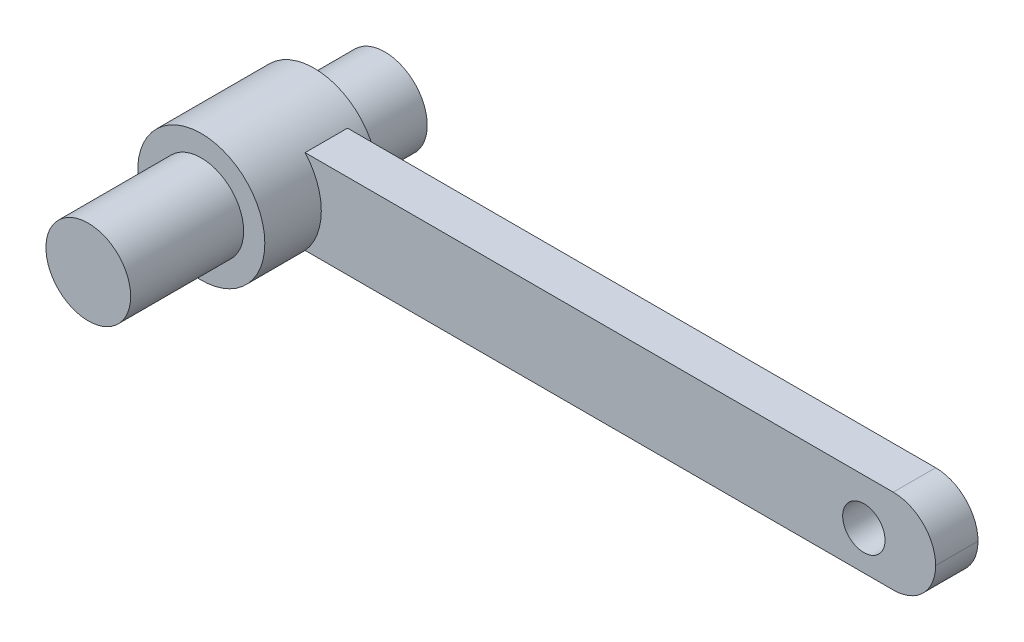
ISO-10303-21;
HEADER;
FILE_DESCRIPTION(('STEP AP214'),'2;1');
FILE_NAME('part.step','',(''),(''),'','','');
FILE_SCHEMA(('AUTOMOTIVE_DESIGN { 1 0 10303 214 1 1 1 1 }'));
ENDSEC;
DATA;
#1=APPLICATION_CONTEXT('core data for automotive mechanical design processes');
#2=APPLICATION_PROTOCOL_DEFINITION('international standard','automotive_design',2000,#1);
#3=PRODUCT_CONTEXT('',#1,'mechanical');
#4=PRODUCT('Part','Part','',(#3));
#5=PRODUCT_RELATED_PRODUCT_CATEGORY('part','',(#4));
#6=PRODUCT_DEFINITION_FORMATION('','',#4);
#7=PRODUCT_DEFINITION_CONTEXT('part definition',#1,'design');
#8=PRODUCT_DEFINITION('design','',#6,#7);
#9=PRODUCT_DEFINITION_SHAPE('','',#8);
#10=(LENGTH_UNIT() NAMED_UNIT(*) SI_UNIT(.MILLI.,.METRE.));
#11=(NAMED_UNIT(*) PLANE_ANGLE_UNIT() SI_UNIT($,.RADIAN.));
#12=(NAMED_UNIT(*) SI_UNIT($,.STERADIAN.) SOLID_ANGLE_UNIT());
#13=UNCERTAINTY_MEASURE_WITH_UNIT(LENGTH_MEASURE(1.E-05),#10,'distance_accuracy_value','');
#14=(GEOMETRIC_REPRESENTATION_CONTEXT(3) GLOBAL_UNCERTAINTY_ASSIGNED_CONTEXT((#13)) GLOBAL_UNIT_ASSIGNED_CONTEXT((#10,
#11,#12)) REPRESENTATION_CONTEXT('',''));
#15=CARTESIAN_POINT('',(0.,0.,0.));
#16=DIRECTION('',(0.,0.,1.));
#17=DIRECTION('',(1.,0.,0.));
#18=AXIS2_PLACEMENT_3D('',#15,#16,#17);
#19=CARTESIAN_POINT('',(-10.5,-0.5,0.8));
#20=DIRECTION('',(0.,0.,1.));
#21=DIRECTION('',(1.,0.,0.));
#22=AXIS2_PLACEMENT_3D('',#19,#20,#21);
#23=PLANE('',#22);
#24=CARTESIAN_POINT('',(-10.5,-0.5,0.8));
#25=DIRECTION('',(0.,0.,1.));
#26=DIRECTION('',(1.,0.,0.));
#27=AXIS2_PLACEMENT_3D('',#24,#25,#26);
#28=CIRCLE('',#27,0.45);
#29=CARTESIAN_POINT('',(-10.05,-0.5,0.8));
#30=VERTEX_POINT('',#29);
#31=EDGE_CURVE('E107',#30,#30,#28,.T.);
#32=ORIENTED_EDGE('',*,*,#31,.T.);
#33=EDGE_LOOP('',(#32));
#34=FACE_BOUND('',#33,.T.);
#35=CARTESIAN_POINT('',(-10.5,-0.5,0.8));
#36=DIRECTION('',(0.,0.,1.));
#37=DIRECTION('',(1.,0.,0.));
#38=AXIS2_PLACEMENT_3D('',#35,#36,#37);
#39=CIRCLE('',#38,0.3);
#40=CARTESIAN_POINT('',(-10.2,-0.5,0.8));
#41=VERTEX_POINT('',#40);
#42=EDGE_CURVE('E143',#41,#41,#39,.T.);
#43=ORIENTED_EDGE('',*,*,#42,.F.);
#44=EDGE_LOOP('',(#43));
#45=FACE_BOUND('',#44,.T.);
#46=ADVANCED_FACE('F30',(#34,#45),#23,.T.);
#47=CARTESIAN_POINT('',(-10.5,-0.5,0.));
#48=DIRECTION('',(0.,0.,1.));
#49=DIRECTION('',(1.,0.,0.));
#50=AXIS2_PLACEMENT_3D('',#47,#48,#49);
#51=PLANE('',#50);
#52=CARTESIAN_POINT('',(-10.5,-0.5,0.));
#53=DIRECTION('',(0.,0.,1.));
#54=DIRECTION('',(1.,0.,0.));
#55=AXIS2_PLACEMENT_3D('',#52,#53,#54);
#56=CIRCLE('',#55,0.45);
#57=CARTESIAN_POINT('',(-10.05,-0.5,0.));
#58=VERTEX_POINT('',#57);
#59=EDGE_CURVE('E146',#58,#58,#56,.T.);
#60=ORIENTED_EDGE('',*,*,#59,.F.);
#61=EDGE_LOOP('',(#60));
#62=FACE_BOUND('',#61,.T.);
#63=CARTESIAN_POINT('',(-10.5,-0.5,0.));
#64=DIRECTION('',(0.,0.,1.));
#65=DIRECTION('',(1.,0.,0.));
#66=AXIS2_PLACEMENT_3D('',#63,#64,#65);
#67=CIRCLE('',#66,0.3);
#68=CARTESIAN_POINT('',(-10.2,-0.5,0.));
#69=VERTEX_POINT('',#68);
#70=EDGE_CURVE('E125',#69,#69,#67,.T.);
#71=ORIENTED_EDGE('',*,*,#70,.T.);
#72=EDGE_LOOP('',(#71));
#73=FACE_BOUND('',#72,.T.);
#74=ADVANCED_FACE('F152',(#62,#73),#51,.F.);
#75=CARTESIAN_POINT('',(-10.5,-0.5,0.8));
#76=DIRECTION('',(0.,0.,-1.));
#77=DIRECTION('',(-1.,0.,0.));
#78=AXIS2_PLACEMENT_3D('',#75,#76,#77);
#79=CYLINDRICAL_SURFACE('',#78,0.45);
#80=CARTESIAN_POINT('',(-10.5,-0.5,0.0999999999999578));
#81=DIRECTION('',(0.,0.,-1.));
#82=DIRECTION('',(0.,1.,0.));
#83=AXIS2_PLACEMENT_3D('',#80,#81,#82);
#84=CIRCLE('',#83,0.45);
#85=CARTESIAN_POINT('',(-10.164589803375,-0.200000000000002,0.0999999999999578));
#86=VERTEX_POINT('',#85);
#87=CARTESIAN_POINT('',(-10.164589803375,-0.799999999999999,0.0999999999999578));
#88=VERTEX_POINT('',#87);
#89=EDGE_CURVE('E97',#86,#88,#84,.T.);
#90=ORIENTED_EDGE('',*,*,#89,.T.);
#91=DIRECTION('',(0.,0.,-1.));
#92=VECTOR('',#91,1.);
#93=CARTESIAN_POINT('',(-10.164589803375,-0.799999999999999,0.8));
#94=LINE('',#93,#92);
#95=CARTESIAN_POINT('',(-10.164589803375,-0.8,0.399999999999958));
#96=VERTEX_POINT('',#95);
#97=EDGE_CURVE('E83',#88,#96,#94,.F.);
#98=ORIENTED_EDGE('',*,*,#97,.T.);
#99=CARTESIAN_POINT('',(-10.5,-0.5,0.399999999999958));
#100=DIRECTION('',(0.,0.,1.));
#101=DIRECTION('',(0.,-1.,0.));
#102=AXIS2_PLACEMENT_3D('',#99,#100,#101);
#103=CIRCLE('',#102,0.45);
#104=CARTESIAN_POINT('',(-10.164589803375,-0.200000000000001,0.399999999999958));
#105=VERTEX_POINT('',#104);
#106=EDGE_CURVE('E92',#96,#105,#103,.T.);
#107=ORIENTED_EDGE('',*,*,#106,.T.);
#108=DIRECTION('',(0.,0.,-1.));
#109=VECTOR('',#108,1.);
#110=CARTESIAN_POINT('',(-10.164589803375,-0.199999999999999,0.8));
#111=LINE('',#110,#109);
#112=EDGE_CURVE('E103',#105,#86,#111,.T.);
#113=ORIENTED_EDGE('',*,*,#112,.T.);
#114=EDGE_LOOP('',(#90,#98,#107,#113));
#115=FACE_BOUND('',#114,.T.);
#116=ORIENTED_EDGE('',*,*,#31,.F.);
#117=EDGE_LOOP('',(#116));
#118=FACE_BOUND('',#117,.T.);
#119=ORIENTED_EDGE('',*,*,#59,.T.);
#120=EDGE_LOOP('',(#119));
#121=FACE_BOUND('',#120,.T.);
#122=ADVANCED_FACE('F100',(#115,#118,#121),#79,.T.);
#123=CARTESIAN_POINT('',(-5.69999999999998,-0.799999999999999,-0.413197170165134));
#124=DIRECTION('',(0.,-1.,0.));
#125=DIRECTION('',(0.,0.,-1.));
#126=AXIS2_PLACEMENT_3D('',#123,#124,#125);
#127=PLANE('',#126);
#128=DIRECTION('',(-1.,0.,0.));
#129=VECTOR('',#128,1.);
#130=CARTESIAN_POINT('',(-5.69999999999993,-0.799999999999999,0.0999999999999578));
#131=LINE('',#130,#129);
#132=CARTESIAN_POINT('',(-5.99999999999993,-0.799999999999999,0.0999999999999578));
#133=VERTEX_POINT('',#132);
#134=EDGE_CURVE('E98',#133,#88,#131,.T.);
#135=ORIENTED_EDGE('',*,*,#134,.F.);
#136=DIRECTION('',(0.,0.,1.));
#137=VECTOR('',#136,1.);
#138=CARTESIAN_POINT('',(-5.99999999999993,-0.799999999999999,-0.413197170165134));
#139=LINE('',#138,#137);
#140=CARTESIAN_POINT('',(-5.99999999999993,-0.8,0.399999999999958));
#141=VERTEX_POINT('',#140);
#142=EDGE_CURVE('E86',#133,#141,#139,.T.);
#143=ORIENTED_EDGE('',*,*,#142,.T.);
#144=DIRECTION('',(-1.,0.,0.));
#145=VECTOR('',#144,1.);
#146=CARTESIAN_POINT('',(-5.7,-0.8,0.399999999999958));
#147=LINE('',#146,#145);
#148=EDGE_CURVE('E78',#141,#96,#147,.T.);
#149=ORIENTED_EDGE('',*,*,#148,.T.);
#150=ORIENTED_EDGE('',*,*,#97,.F.);
#151=EDGE_LOOP('',(#135,#143,#149,#150));
#152=FACE_BOUND('',#151,.T.);
#153=ADVANCED_FACE('F81',(#152),#127,.T.);
#154=CARTESIAN_POINT('',(-5.69999999999993,-0.199999999999999,-0.413197170165134));
#155=DIRECTION('',(0.,1.,0.));
#156=DIRECTION('',(0.,0.,1.));
#157=AXIS2_PLACEMENT_3D('',#154,#155,#156);
#158=PLANE('',#157);
#159=DIRECTION('',(-1.,0.,0.));
#160=VECTOR('',#159,1.);
#161=CARTESIAN_POINT('',(-5.7,-0.200000000000001,0.399999999999958));
#162=LINE('',#161,#160);
#163=CARTESIAN_POINT('',(-5.99999999999993,-0.200000000000001,0.399999999999958));
#164=VERTEX_POINT('',#163);
#165=EDGE_CURVE('E88',#164,#105,#162,.T.);
#166=ORIENTED_EDGE('',*,*,#165,.F.);
#167=DIRECTION('',(0.,0.,-1.));
#168=VECTOR('',#167,1.);
#169=CARTESIAN_POINT('',(-5.99999999999993,-0.199999999999999,-0.413197170165134));
#170=LINE('',#169,#168);
#171=CARTESIAN_POINT('',(-5.99999999999993,-0.200000000000002,0.0999999999999578));
#172=VERTEX_POINT('',#171);
#173=EDGE_CURVE('E11',#164,#172,#170,.T.);
#174=ORIENTED_EDGE('',*,*,#173,.T.);
#175=DIRECTION('',(-1.,0.,0.));
#176=VECTOR('',#175,1.);
#177=CARTESIAN_POINT('',(-5.6999999999999,-0.200000000000002,0.0999999999999578));
#178=LINE('',#177,#176);
#179=EDGE_CURVE('E119',#172,#86,#178,.T.);
#180=ORIENTED_EDGE('',*,*,#179,.T.);
#181=ORIENTED_EDGE('',*,*,#112,.F.);
#182=EDGE_LOOP('',(#166,#174,#180,#181));
#183=FACE_BOUND('',#182,.T.);
#184=ADVANCED_FACE('F187',(#183),#158,.T.);
#185=CARTESIAN_POINT('',(-5.69999999999992,-0.499999999999999,0.0999999999999578));
#186=DIRECTION('',(0.,0.,-1.));
#187=DIRECTION('',(0.,1.,0.));
#188=AXIS2_PLACEMENT_3D('',#185,#186,#187);
#189=PLANE('',#188);
#190=CARTESIAN_POINT('',(-6.2082255628475,-0.524292893526734,0.0999999999999578));
#191=DIRECTION('',(0.,0.,-1.));
#192=DIRECTION('',(0.,1.,0.));
#193=AXIS2_PLACEMENT_3D('',#190,#191,#192);
#194=CIRCLE('',#193,0.15);
#195=CARTESIAN_POINT('',(-6.2082255628475,-0.374292893526734,0.0999999999999578));
#196=VERTEX_POINT('',#195);
#197=EDGE_CURVE('E89',#196,#196,#194,.T.);
#198=ORIENTED_EDGE('',*,*,#197,.F.);
#199=EDGE_LOOP('',(#198));
#200=FACE_BOUND('',#199,.T.);
#201=CARTESIAN_POINT('',(-5.99999999999993,-0.499999999999999,0.0999999999999578));
#202=DIRECTION('',(0.,0.,-1.));
#203=DIRECTION('',(0.,1.,0.));
#204=AXIS2_PLACEMENT_3D('',#201,#202,#203);
#205=CIRCLE('',#204,0.3);
#206=CARTESIAN_POINT('',(-5.69999999999992,-0.499999999999999,0.0999999999999578));
#207=VERTEX_POINT('',#206);
#208=EDGE_CURVE('E46',#172,#207,#205,.T.);
#209=ORIENTED_EDGE('',*,*,#208,.T.);
#210=CARTESIAN_POINT('',(-5.99999999999993,-0.5,0.0999999999999578));
#211=DIRECTION('',(0.,0.,-1.));
#212=DIRECTION('',(0.,1.,0.));
#213=AXIS2_PLACEMENT_3D('',#210,#211,#212);
#214=CIRCLE('',#213,0.3);
#215=EDGE_CURVE('E39',#207,#133,#214,.T.);
#216=ORIENTED_EDGE('',*,*,#215,.T.);
#217=ORIENTED_EDGE('',*,*,#134,.T.);
#218=ORIENTED_EDGE('',*,*,#89,.F.);
#219=ORIENTED_EDGE('',*,*,#179,.F.);
#220=EDGE_LOOP('',(#209,#216,#217,#218,#219));
#221=FACE_BOUND('',#220,.T.);
#222=ADVANCED_FACE('F116',(#200,#221),#189,.T.);
#223=CARTESIAN_POINT('',(-5.69999999999993,-0.5,0.399999999999958));
#224=DIRECTION('',(0.,0.,1.));
#225=DIRECTION('',(0.,-1.,0.));
#226=AXIS2_PLACEMENT_3D('',#223,#224,#225);
#227=PLANE('',#226);
#228=CARTESIAN_POINT('',(-6.2082255628475,-0.524292893526734,0.399999999999958));
#229=DIRECTION('',(0.,0.,1.));
#230=DIRECTION('',(1.,0.,0.));
#231=AXIS2_PLACEMENT_3D('',#228,#229,#230);
#232=CIRCLE('',#231,0.15);
#233=CARTESIAN_POINT('',(-6.0582255628475,-0.524292893526734,0.399999999999958));
#234=VERTEX_POINT('',#233);
#235=EDGE_CURVE('E124',#234,#234,#232,.T.);
#236=ORIENTED_EDGE('',*,*,#235,.F.);
#237=EDGE_LOOP('',(#236));
#238=FACE_BOUND('',#237,.T.);
#239=ORIENTED_EDGE('',*,*,#148,.F.);
#240=CARTESIAN_POINT('',(-5.99999999999993,-0.5,0.399999999999958));
#241=DIRECTION('',(0.,0.,1.));
#242=DIRECTION('',(0.,-1.,0.));
#243=AXIS2_PLACEMENT_3D('',#240,#241,#242);
#244=CIRCLE('',#243,0.3);
#245=CARTESIAN_POINT('',(-5.69999999999993,-0.499999999999999,0.399999999999958));
#246=VERTEX_POINT('',#245);
#247=EDGE_CURVE('E112',#141,#246,#244,.T.);
#248=ORIENTED_EDGE('',*,*,#247,.T.);
#249=CARTESIAN_POINT('',(-5.99999999999993,-0.499999999999999,0.399999999999958));
#250=DIRECTION('',(0.,0.,1.));
#251=DIRECTION('',(0.,-1.,0.));
#252=AXIS2_PLACEMENT_3D('',#249,#250,#251);
#253=CIRCLE('',#252,0.3);
#254=EDGE_CURVE('E105',#246,#164,#253,.T.);
#255=ORIENTED_EDGE('',*,*,#254,.T.);
#256=ORIENTED_EDGE('',*,*,#165,.T.);
#257=ORIENTED_EDGE('',*,*,#106,.F.);
#258=EDGE_LOOP('',(#239,#248,#255,#256,#257));
#259=FACE_BOUND('',#258,.T.);
#260=ADVANCED_FACE('F93',(#238,#259),#227,.T.);
#261=CARTESIAN_POINT('',(-6.2082255628475,-0.524292893526734,-4.10000000000004));
#262=DIRECTION('',(0.,0.,1.));
#263=DIRECTION('',(1.,0.,0.));
#264=AXIS2_PLACEMENT_3D('',#261,#262,#263);
#265=CYLINDRICAL_SURFACE('',#264,0.15);
#266=ORIENTED_EDGE('',*,*,#197,.T.);
#267=EDGE_LOOP('',(#266));
#268=FACE_BOUND('',#267,.T.);
#269=ORIENTED_EDGE('',*,*,#235,.T.);
#270=EDGE_LOOP('',(#269));
#271=FACE_BOUND('',#270,.T.);
#272=ADVANCED_FACE('F172',(#268,#271),#265,.F.);
#273=CARTESIAN_POINT('',(-5.99999999999993,-0.499999999999999,-0.413197170165134));
#274=DIRECTION('',(0.,0.,-1.));
#275=DIRECTION('',(-1.,0.,0.));
#276=AXIS2_PLACEMENT_3D('',#273,#274,#275);
#277=CYLINDRICAL_SURFACE('',#276,0.3);
#278=DIRECTION('',(0.,0.,-1.));
#279=VECTOR('',#278,1.);
#280=CARTESIAN_POINT('',(-5.69999999999993,-0.499999999999999,-0.413197170165134));
#281=LINE('',#280,#279);
#282=EDGE_CURVE('E34',#207,#246,#281,.F.);
#283=ORIENTED_EDGE('',*,*,#282,.F.);
#284=ORIENTED_EDGE('',*,*,#208,.F.);
#285=ORIENTED_EDGE('',*,*,#173,.F.);
#286=ORIENTED_EDGE('',*,*,#254,.F.);
#287=EDGE_LOOP('',(#283,#284,#285,#286));
#288=FACE_BOUND('',#287,.T.);
#289=ADVANCED_FACE('F32',(#288),#277,.T.);
#290=CARTESIAN_POINT('',(-5.99999999999993,-0.5,-0.413197170165134));
#291=DIRECTION('',(0.,0.,1.));
#292=DIRECTION('',(1.,0.,0.));
#293=AXIS2_PLACEMENT_3D('',#290,#291,#292);
#294=CYLINDRICAL_SURFACE('',#293,0.3);
#295=ORIENTED_EDGE('',*,*,#215,.F.);
#296=ORIENTED_EDGE('',*,*,#282,.T.);
#297=ORIENTED_EDGE('',*,*,#247,.F.);
#298=ORIENTED_EDGE('',*,*,#142,.F.);
#299=EDGE_LOOP('',(#295,#296,#297,#298));
#300=FACE_BOUND('',#299,.T.);
#301=ADVANCED_FACE('F121',(#300),#294,.T.);
#302=CARTESIAN_POINT('',(-10.5,-0.5,-0.5));
#303=DIRECTION('',(0.,0.,1.));
#304=DIRECTION('',(1.,0.,0.));
#305=AXIS2_PLACEMENT_3D('',#302,#303,#304);
#306=PLANE('',#305);
#307=CARTESIAN_POINT('',(-10.5,-0.5,-0.5));
#308=DIRECTION('',(0.,0.,1.));
#309=DIRECTION('',(1.,0.,0.));
#310=AXIS2_PLACEMENT_3D('',#307,#308,#309);
#311=CIRCLE('',#310,0.3);
#312=CARTESIAN_POINT('',(-10.2,-0.5,-0.5));
#313=VERTEX_POINT('',#312);
#314=EDGE_CURVE('E129',#313,#313,#311,.T.);
#315=ORIENTED_EDGE('',*,*,#314,.F.);
#316=EDGE_LOOP('',(#315));
#317=FACE_BOUND('',#316,.T.);
#318=ADVANCED_FACE('F164',(#317),#306,.F.);
#319=CARTESIAN_POINT('',(-10.5,-0.5,-0.5));
#320=DIRECTION('',(0.,0.,1.));
#321=DIRECTION('',(1.,0.,0.));
#322=AXIS2_PLACEMENT_3D('',#319,#320,#321);
#323=CYLINDRICAL_SURFACE('',#322,0.3);
#324=ORIENTED_EDGE('',*,*,#314,.T.);
#325=EDGE_LOOP('',(#324));
#326=FACE_BOUND('',#325,.T.);
#327=ORIENTED_EDGE('',*,*,#70,.F.);
#328=EDGE_LOOP('',(#327));
#329=FACE_BOUND('',#328,.T.);
#330=ADVANCED_FACE('F169',(#326,#329),#323,.T.);
#331=ORIENTED_EDGE('',*,*,#42,.T.);
#332=EDGE_LOOP('',(#331));
#333=FACE_BOUND('',#332,.T.);
#334=CARTESIAN_POINT('',(-10.5,-0.5,1.6));
#335=DIRECTION('',(0.,0.,1.));
#336=DIRECTION('',(1.,0.,0.));
#337=AXIS2_PLACEMENT_3D('',#334,#335,#336);
#338=CIRCLE('',#337,0.3);
#339=CARTESIAN_POINT('',(-10.2,-0.5,1.6));
#340=VERTEX_POINT('',#339);
#341=EDGE_CURVE('E134',#340,#340,#338,.T.);
#342=ORIENTED_EDGE('',*,*,#341,.F.);
#343=EDGE_LOOP('',(#342));
#344=FACE_BOUND('',#343,.T.);
#345=ADVANCED_FACE('F185',(#333,#344),#323,.T.);
#346=CARTESIAN_POINT('',(-10.5,-0.5,1.6));
#347=DIRECTION('',(0.,0.,1.));
#348=DIRECTION('',(1.,0.,0.));
#349=AXIS2_PLACEMENT_3D('',#346,#347,#348);
#350=PLANE('',#349);
#351=ORIENTED_EDGE('',*,*,#341,.T.);
#352=EDGE_LOOP('',(#351));
#353=FACE_BOUND('',#352,.T.);
#354=ADVANCED_FACE('F241',(#353),#350,.T.);
#355=CLOSED_SHELL('',(#46,#74,#122,#153,#184,#222,#260,#272,#289,#301,#318,#330,#345,#354));
#356=MANIFOLD_SOLID_BREP('B2',#355);
#357=ADVANCED_BREP_SHAPE_REPRESENTATION('',(#18,#356),#14);
#358=SHAPE_DEFINITION_REPRESENTATION(#9,#357);
ENDSEC;
END-ISO-10303-21;
